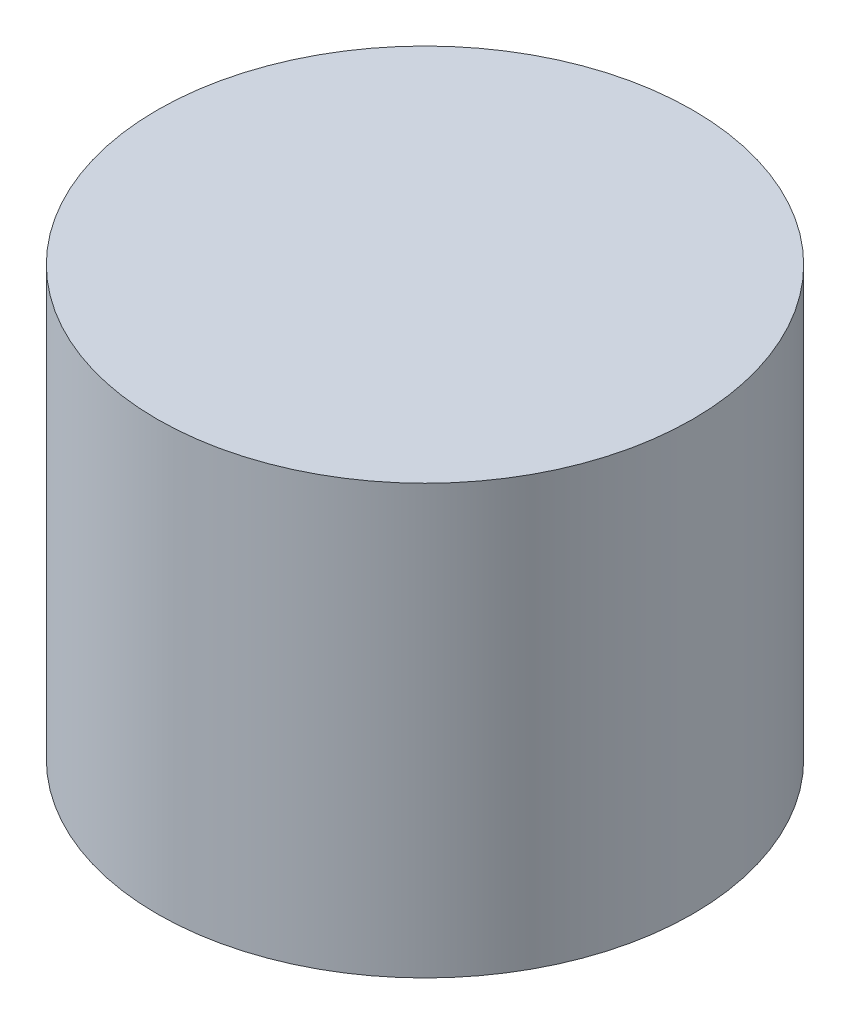
ISO-10303-21;
HEADER;
FILE_DESCRIPTION(('STEP AP214'),'2;1');
FILE_NAME('part.step','',(''),(''),'','','');
FILE_SCHEMA(('AUTOMOTIVE_DESIGN { 1 0 10303 214 1 1 1 1 }'));
ENDSEC;
DATA;
#1=APPLICATION_CONTEXT('core data for automotive mechanical design processes');
#2=APPLICATION_PROTOCOL_DEFINITION('international standard','automotive_design',2000,#1);
#3=PRODUCT_CONTEXT('',#1,'mechanical');
#4=PRODUCT('Part','Part','',(#3));
#5=PRODUCT_RELATED_PRODUCT_CATEGORY('part','',(#4));
#6=PRODUCT_DEFINITION_FORMATION('','',#4);
#7=PRODUCT_DEFINITION_CONTEXT('part definition',#1,'design');
#8=PRODUCT_DEFINITION('design','',#6,#7);
#9=PRODUCT_DEFINITION_SHAPE('','',#8);
#10=(LENGTH_UNIT() NAMED_UNIT(*) SI_UNIT(.MILLI.,.METRE.));
#11=(NAMED_UNIT(*) PLANE_ANGLE_UNIT() SI_UNIT($,.RADIAN.));
#12=(NAMED_UNIT(*) SI_UNIT($,.STERADIAN.) SOLID_ANGLE_UNIT());
#13=UNCERTAINTY_MEASURE_WITH_UNIT(LENGTH_MEASURE(1.E-05),#10,'distance_accuracy_value','');
#14=(GEOMETRIC_REPRESENTATION_CONTEXT(3) GLOBAL_UNCERTAINTY_ASSIGNED_CONTEXT((#13)) GLOBAL_UNIT_ASSIGNED_CONTEXT((#10,
#11,#12)) REPRESENTATION_CONTEXT('',''));
#15=CARTESIAN_POINT('',(0.,0.,0.));
#16=DIRECTION('',(0.,0.,1.));
#17=DIRECTION('',(1.,0.,0.));
#18=AXIS2_PLACEMENT_3D('',#15,#16,#17);
#19=CARTESIAN_POINT('',(0.,4.,0.));
#20=DIRECTION('',(0.,-1.,0.));
#21=DIRECTION('',(0.,0.,-1.));
#22=AXIS2_PLACEMENT_3D('',#19,#20,#21);
#23=CYLINDRICAL_SURFACE('',#22,2.5);
#24=CARTESIAN_POINT('',(0.,4.,0.));
#25=DIRECTION('',(0.,1.,0.));
#26=DIRECTION('',(0.,0.,1.));
#27=AXIS2_PLACEMENT_3D('',#24,#25,#26);
#28=CIRCLE('',#27,2.5);
#29=CARTESIAN_POINT('',(0.,4.,2.5));
#30=VERTEX_POINT('',#29);
#31=EDGE_CURVE('E10',#30,#30,#28,.T.);
#32=ORIENTED_EDGE('',*,*,#31,.F.);
#33=EDGE_LOOP('',(#32));
#34=FACE_BOUND('',#33,.T.);
#35=CARTESIAN_POINT('',(0.,0.,0.));
#36=DIRECTION('',(0.,1.,0.));
#37=DIRECTION('',(0.,0.,1.));
#38=AXIS2_PLACEMENT_3D('',#35,#36,#37);
#39=CIRCLE('',#38,2.5);
#40=CARTESIAN_POINT('',(0.,0.,2.5));
#41=VERTEX_POINT('',#40);
#42=EDGE_CURVE('E35',#41,#41,#39,.T.);
#43=ORIENTED_EDGE('',*,*,#42,.T.);
#44=EDGE_LOOP('',(#43));
#45=FACE_BOUND('',#44,.T.);
#46=ADVANCED_FACE('F32',(#34,#45),#23,.T.);
#47=CARTESIAN_POINT('',(0.,4.,0.));
#48=DIRECTION('',(0.,1.,0.));
#49=DIRECTION('',(0.,0.,1.));
#50=AXIS2_PLACEMENT_3D('',#47,#48,#49);
#51=PLANE('',#50);
#52=ORIENTED_EDGE('',*,*,#31,.T.);
#53=EDGE_LOOP('',(#52));
#54=FACE_BOUND('',#53,.T.);
#55=ADVANCED_FACE('F47',(#54),#51,.T.);
#56=CARTESIAN_POINT('',(0.,0.,0.));
#57=DIRECTION('',(0.,1.,0.));
#58=DIRECTION('',(0.,0.,1.));
#59=AXIS2_PLACEMENT_3D('',#56,#57,#58);
#60=PLANE('',#59);
#61=ORIENTED_EDGE('',*,*,#42,.F.);
#62=EDGE_LOOP('',(#61));
#63=FACE_BOUND('',#62,.T.);
#64=ADVANCED_FACE('F45',(#63),#60,.F.);
#65=CLOSED_SHELL('',(#46,#55,#64));
#66=MANIFOLD_SOLID_BREP('B2',#65);
#67=ADVANCED_BREP_SHAPE_REPRESENTATION('',(#18,#66),#14);
#68=SHAPE_DEFINITION_REPRESENTATION(#9,#67);
ENDSEC;
END-ISO-10303-21;
